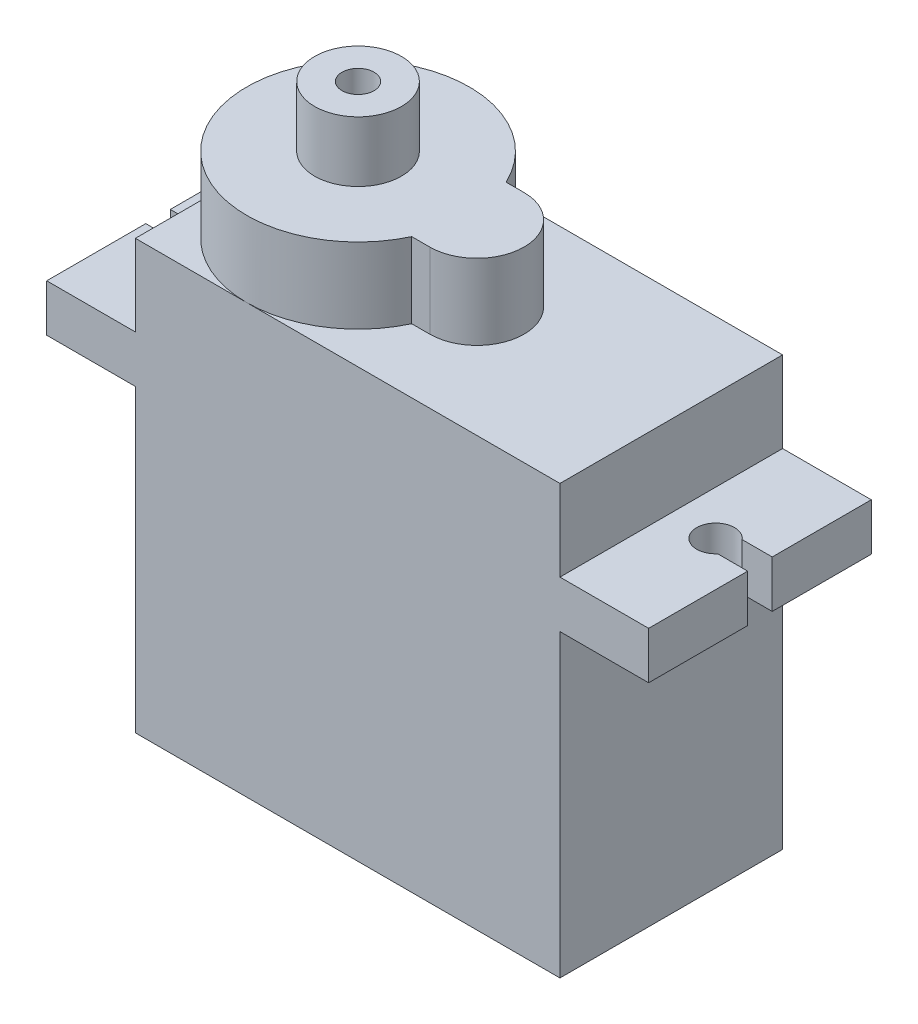
ISO-10303-21;
HEADER;
FILE_DESCRIPTION(('STEP AP214'),'2;1');
FILE_NAME('part.step','',(''),(''),'','','');
FILE_SCHEMA(('AUTOMOTIVE_DESIGN { 1 0 10303 214 1 1 1 1 }'));
ENDSEC;
DATA;
#1=APPLICATION_CONTEXT('core data for automotive mechanical design processes');
#2=APPLICATION_PROTOCOL_DEFINITION('international standard','automotive_design',2000,#1);
#3=PRODUCT_CONTEXT('',#1,'mechanical');
#4=PRODUCT('Part','Part','',(#3));
#5=PRODUCT_RELATED_PRODUCT_CATEGORY('part','',(#4));
#6=PRODUCT_DEFINITION_FORMATION('','',#4);
#7=PRODUCT_DEFINITION_CONTEXT('part definition',#1,'design');
#8=PRODUCT_DEFINITION('design','',#6,#7);
#9=PRODUCT_DEFINITION_SHAPE('','',#8);
#10=(LENGTH_UNIT() NAMED_UNIT(*) SI_UNIT(.MILLI.,.METRE.));
#11=(NAMED_UNIT(*) PLANE_ANGLE_UNIT() SI_UNIT($,.RADIAN.));
#12=(NAMED_UNIT(*) SI_UNIT($,.STERADIAN.) SOLID_ANGLE_UNIT());
#13=UNCERTAINTY_MEASURE_WITH_UNIT(LENGTH_MEASURE(1.E-05),#10,'distance_accuracy_value','');
#14=(GEOMETRIC_REPRESENTATION_CONTEXT(3) GLOBAL_UNCERTAINTY_ASSIGNED_CONTEXT((#13)) GLOBAL_UNIT_ASSIGNED_CONTEXT((#10,
#11,#12)) REPRESENTATION_CONTEXT('',''));
#15=CARTESIAN_POINT('',(0.,0.,0.));
#16=DIRECTION('',(0.,0.,1.));
#17=DIRECTION('',(1.,0.,0.));
#18=AXIS2_PLACEMENT_3D('',#15,#16,#17);
#19=CARTESIAN_POINT('',(-4.7,18.39999995,-11.8));
#20=DIRECTION('',(-1.,0.,0.));
#21=DIRECTION('',(0.,0.,1.));
#22=AXIS2_PLACEMENT_3D('',#19,#20,#21);
#23=PLANE('',#22);
#24=DIRECTION('',(0.,1.,0.));
#25=VECTOR('',#24,1.);
#26=CARTESIAN_POINT('',(-4.7,11.9983977150201,-5.25));
#27=LINE('',#26,#25);
#28=CARTESIAN_POINT('',(-4.7,15.89999995,-5.25));
#29=VERTEX_POINT('',#28);
#30=CARTESIAN_POINT('',(-4.7,18.39999995,-5.25));
#31=VERTEX_POINT('',#30);
#32=EDGE_CURVE('E208',#29,#31,#27,.T.);
#33=ORIENTED_EDGE('',*,*,#32,.F.);
#34=DIRECTION('',(0.,0.,-1.));
#35=VECTOR('',#34,1.);
#36=CARTESIAN_POINT('',(-4.7,15.89999995,-11.8));
#37=LINE('',#36,#35);
#38=CARTESIAN_POINT('',(-4.7,15.89999995,0.));
#39=VERTEX_POINT('',#38);
#40=EDGE_CURVE('E218',#39,#29,#37,.T.);
#41=ORIENTED_EDGE('',*,*,#40,.F.);
#42=DIRECTION('',(0.,-1.,0.));
#43=VECTOR('',#42,1.);
#44=CARTESIAN_POINT('',(-4.7,18.39999995,0.));
#45=LINE('',#44,#43);
#46=CARTESIAN_POINT('',(-4.7,18.39999995,0.));
#47=VERTEX_POINT('',#46);
#48=EDGE_CURVE('E241',#47,#39,#45,.T.);
#49=ORIENTED_EDGE('',*,*,#48,.F.);
#50=DIRECTION('',(0.,0.,-1.));
#51=VECTOR('',#50,1.);
#52=CARTESIAN_POINT('',(-4.7,18.39999995,-11.8));
#53=LINE('',#52,#51);
#54=EDGE_CURVE('E221',#47,#31,#53,.T.);
#55=ORIENTED_EDGE('',*,*,#54,.T.);
#56=EDGE_LOOP('',(#33,#41,#49,#55));
#57=FACE_BOUND('',#56,.T.);
#58=ADVANCED_FACE('F34',(#57),#23,.T.);
#59=CARTESIAN_POINT('',(27.2,18.39999995,-11.8));
#60=DIRECTION('',(1.,0.,0.));
#61=DIRECTION('',(0.,0.,-1.));
#62=AXIS2_PLACEMENT_3D('',#59,#60,#61);
#63=PLANE('',#62);
#64=DIRECTION('',(0.,1.,0.));
#65=VECTOR('',#64,1.);
#66=CARTESIAN_POINT('',(27.2,11.9983977150201,-5.25));
#67=LINE('',#66,#65);
#68=CARTESIAN_POINT('',(27.2,15.89999995,-5.25));
#69=VERTEX_POINT('',#68);
#70=CARTESIAN_POINT('',(27.2,18.39999995,-5.25));
#71=VERTEX_POINT('',#70);
#72=EDGE_CURVE('E391',#69,#71,#67,.T.);
#73=ORIENTED_EDGE('',*,*,#72,.T.);
#74=DIRECTION('',(0.,0.,1.));
#75=VECTOR('',#74,1.);
#76=CARTESIAN_POINT('',(27.2,18.39999995,-11.8));
#77=LINE('',#76,#75);
#78=CARTESIAN_POINT('',(27.2,18.39999995,0.));
#79=VERTEX_POINT('',#78);
#80=EDGE_CURVE('E429',#71,#79,#77,.T.);
#81=ORIENTED_EDGE('',*,*,#80,.T.);
#82=DIRECTION('',(0.,-1.,0.));
#83=VECTOR('',#82,1.);
#84=CARTESIAN_POINT('',(27.2,18.39999995,0.));
#85=LINE('',#84,#83);
#86=CARTESIAN_POINT('',(27.2,15.89999995,0.));
#87=VERTEX_POINT('',#86);
#88=EDGE_CURVE('E321',#79,#87,#85,.T.);
#89=ORIENTED_EDGE('',*,*,#88,.T.);
#90=DIRECTION('',(0.,0.,1.));
#91=VECTOR('',#90,1.);
#92=CARTESIAN_POINT('',(27.2,15.89999995,-11.8));
#93=LINE('',#92,#91);
#94=EDGE_CURVE('E331',#69,#87,#93,.T.);
#95=ORIENTED_EDGE('',*,*,#94,.F.);
#96=EDGE_LOOP('',(#73,#81,#89,#95));
#97=FACE_BOUND('',#96,.T.);
#98=ADVANCED_FACE('F437',(#97),#63,.T.);
#99=CARTESIAN_POINT('',(0.,22.7,0.));
#100=DIRECTION('',(0.,-1.,0.));
#101=DIRECTION('',(0.,0.,-1.));
#102=AXIS2_PLACEMENT_3D('',#99,#100,#101);
#103=PLANE('',#102);
#104=CARTESIAN_POINT('',(5.9,22.7,-5.9));
#105=DIRECTION('',(0.,1.,0.));
#106=DIRECTION('',(0.,0.,1.));
#107=AXIS2_PLACEMENT_3D('',#104,#105,#106);
#108=CIRCLE('',#107,5.9);
#109=CARTESIAN_POINT('',(0.,22.7,-5.9));
#110=VERTEX_POINT('',#109);
#111=CARTESIAN_POINT('',(5.9,22.7,0.));
#112=VERTEX_POINT('',#111);
#113=EDGE_CURVE('E42',#110,#112,#108,.T.);
#114=ORIENTED_EDGE('',*,*,#113,.F.);
#115=DIRECTION('',(0.,0.,1.));
#116=VECTOR('',#115,1.);
#117=CARTESIAN_POINT('',(0.,22.7,0.));
#118=LINE('',#117,#116);
#119=CARTESIAN_POINT('',(0.,22.7,0.));
#120=VERTEX_POINT('',#119);
#121=EDGE_CURVE('E248',#110,#120,#118,.T.);
#122=ORIENTED_EDGE('',*,*,#121,.T.);
#123=DIRECTION('',(1.,0.,0.));
#124=VECTOR('',#123,1.);
#125=CARTESIAN_POINT('',(0.,22.7,0.));
#126=LINE('',#125,#124);
#127=EDGE_CURVE('E249',#120,#112,#126,.T.);
#128=ORIENTED_EDGE('',*,*,#127,.T.);
#129=EDGE_LOOP('',(#114,#122,#128));
#130=FACE_BOUND('',#129,.T.);
#131=ADVANCED_FACE('F455',(#130),#103,.F.);
#132=CARTESIAN_POINT('',(11.244155686355,22.7,-3.4));
#133=VERTEX_POINT('',#132);
#134=EDGE_CURVE('E289',#112,#133,#108,.T.);
#135=ORIENTED_EDGE('',*,*,#134,.F.);
#136=CARTESIAN_POINT('',(22.5,22.7,0.));
#137=VERTEX_POINT('',#136);
#138=EDGE_CURVE('E247',#112,#137,#126,.T.);
#139=ORIENTED_EDGE('',*,*,#138,.T.);
#140=DIRECTION('',(0.,0.,-1.));
#141=VECTOR('',#140,1.);
#142=CARTESIAN_POINT('',(22.5,22.7,0.));
#143=LINE('',#142,#141);
#144=CARTESIAN_POINT('',(22.5,22.7,-11.8));
#145=VERTEX_POINT('',#144);
#146=EDGE_CURVE('E252',#137,#145,#143,.T.);
#147=ORIENTED_EDGE('',*,*,#146,.T.);
#148=DIRECTION('',(-1.,0.,0.));
#149=VECTOR('',#148,1.);
#150=CARTESIAN_POINT('',(0.,22.7,-11.8));
#151=LINE('',#150,#149);
#152=CARTESIAN_POINT('',(5.9,22.7,-11.8));
#153=VERTEX_POINT('',#152);
#154=EDGE_CURVE('E255',#145,#153,#151,.T.);
#155=ORIENTED_EDGE('',*,*,#154,.T.);
#156=CARTESIAN_POINT('',(11.244155686355,22.7,-8.4));
#157=VERTEX_POINT('',#156);
#158=EDGE_CURVE('E291',#157,#153,#108,.T.);
#159=ORIENTED_EDGE('',*,*,#158,.F.);
#160=DIRECTION('',(-1.,0.,0.));
#161=VECTOR('',#160,1.);
#162=CARTESIAN_POINT('',(12.2,22.7,-8.4));
#163=LINE('',#162,#161);
#164=CARTESIAN_POINT('',(12.2,22.7,-8.4));
#165=VERTEX_POINT('',#164);
#166=EDGE_CURVE('E410',#165,#157,#163,.T.);
#167=ORIENTED_EDGE('',*,*,#166,.F.);
#168=CARTESIAN_POINT('',(12.2,22.7,-5.9));
#169=DIRECTION('',(0.,1.,0.));
#170=DIRECTION('',(0.,0.,1.));
#171=AXIS2_PLACEMENT_3D('',#168,#169,#170);
#172=CIRCLE('',#171,2.5);
#173=CARTESIAN_POINT('',(12.2,22.7,-3.4));
#174=VERTEX_POINT('',#173);
#175=EDGE_CURVE('E371',#174,#165,#172,.T.);
#176=ORIENTED_EDGE('',*,*,#175,.F.);
#177=DIRECTION('',(1.,0.,0.));
#178=VECTOR('',#177,1.);
#179=CARTESIAN_POINT('',(12.2,22.7,-3.4));
#180=LINE('',#179,#178);
#181=EDGE_CURVE('E401',#133,#174,#180,.T.);
#182=ORIENTED_EDGE('',*,*,#181,.F.);
#183=EDGE_LOOP('',(#135,#139,#147,#155,#159,#167,#176,#182));
#184=FACE_BOUND('',#183,.T.);
#185=ADVANCED_FACE('F451',(#184),#103,.F.);
#186=EDGE_CURVE('E283',#153,#110,#108,.T.);
#187=ORIENTED_EDGE('',*,*,#186,.F.);
#188=CARTESIAN_POINT('',(0.,22.7,-11.8));
#189=VERTEX_POINT('',#188);
#190=EDGE_CURVE('E254',#153,#189,#151,.T.);
#191=ORIENTED_EDGE('',*,*,#190,.T.);
#192=EDGE_CURVE('E244',#189,#110,#118,.T.);
#193=ORIENTED_EDGE('',*,*,#192,.T.);
#194=EDGE_LOOP('',(#187,#191,#193));
#195=FACE_BOUND('',#194,.T.);
#196=ADVANCED_FACE('F461',(#195),#103,.F.);
#197=CARTESIAN_POINT('',(22.5,22.7,0.));
#198=DIRECTION('',(-1.,0.,0.));
#199=DIRECTION('',(0.,0.,1.));
#200=AXIS2_PLACEMENT_3D('',#197,#198,#199);
#201=PLANE('',#200);
#202=DIRECTION('',(0.,0.,-1.));
#203=VECTOR('',#202,1.);
#204=CARTESIAN_POINT('',(22.5,15.89999995,-11.8));
#205=LINE('',#204,#203);
#206=CARTESIAN_POINT('',(22.5,15.89999995,0.));
#207=VERTEX_POINT('',#206);
#208=CARTESIAN_POINT('',(22.5,15.89999995,-11.8));
#209=VERTEX_POINT('',#208);
#210=EDGE_CURVE('E315',#207,#209,#205,.T.);
#211=ORIENTED_EDGE('',*,*,#210,.F.);
#212=DIRECTION('',(0.,-1.,0.));
#213=VECTOR('',#212,1.);
#214=CARTESIAN_POINT('',(22.5,22.7,0.));
#215=LINE('',#214,#213);
#216=CARTESIAN_POINT('',(22.5,0.,0.));
#217=VERTEX_POINT('',#216);
#218=EDGE_CURVE('E277',#207,#217,#215,.T.);
#219=ORIENTED_EDGE('',*,*,#218,.T.);
#220=DIRECTION('',(0.,0.,-1.));
#221=VECTOR('',#220,1.);
#222=CARTESIAN_POINT('',(22.5,0.,0.));
#223=LINE('',#222,#221);
#224=CARTESIAN_POINT('',(22.5,0.,-11.8));
#225=VERTEX_POINT('',#224);
#226=EDGE_CURVE('E264',#217,#225,#223,.T.);
#227=ORIENTED_EDGE('',*,*,#226,.T.);
#228=DIRECTION('',(0.,-1.,0.));
#229=VECTOR('',#228,1.);
#230=CARTESIAN_POINT('',(22.5,22.7,-11.8));
#231=LINE('',#230,#229);
#232=EDGE_CURVE('E273',#209,#225,#231,.T.);
#233=ORIENTED_EDGE('',*,*,#232,.F.);
#234=EDGE_LOOP('',(#211,#219,#227,#233));
#235=FACE_BOUND('',#234,.T.);
#236=ADVANCED_FACE('F314',(#235),#201,.F.);
#237=CARTESIAN_POINT('',(0.,22.7,0.));
#238=DIRECTION('',(1.,0.,0.));
#239=DIRECTION('',(0.,0.,-1.));
#240=AXIS2_PLACEMENT_3D('',#237,#238,#239);
#241=PLANE('',#240);
#242=DIRECTION('',(0.,0.,1.));
#243=VECTOR('',#242,1.);
#244=CARTESIAN_POINT('',(0.,15.89999995,0.));
#245=LINE('',#244,#243);
#246=CARTESIAN_POINT('',(0.,15.89999995,-11.8));
#247=VERTEX_POINT('',#246);
#248=CARTESIAN_POINT('',(0.,15.89999995,0.));
#249=VERTEX_POINT('',#248);
#250=EDGE_CURVE('E230',#247,#249,#245,.T.);
#251=ORIENTED_EDGE('',*,*,#250,.F.);
#252=DIRECTION('',(0.,-1.,0.));
#253=VECTOR('',#252,1.);
#254=CARTESIAN_POINT('',(0.,22.7,-11.8));
#255=LINE('',#254,#253);
#256=CARTESIAN_POINT('',(0.,0.,-11.8));
#257=VERTEX_POINT('',#256);
#258=EDGE_CURVE('E258',#247,#257,#255,.T.);
#259=ORIENTED_EDGE('',*,*,#258,.T.);
#260=DIRECTION('',(0.,0.,1.));
#261=VECTOR('',#260,1.);
#262=CARTESIAN_POINT('',(0.,0.,0.));
#263=LINE('',#262,#261);
#264=CARTESIAN_POINT('',(0.,0.,0.));
#265=VERTEX_POINT('',#264);
#266=EDGE_CURVE('E240',#257,#265,#263,.T.);
#267=ORIENTED_EDGE('',*,*,#266,.T.);
#268=DIRECTION('',(0.,-1.,0.));
#269=VECTOR('',#268,1.);
#270=CARTESIAN_POINT('',(0.,22.7,0.));
#271=LINE('',#270,#269);
#272=EDGE_CURVE('E280',#249,#265,#271,.T.);
#273=ORIENTED_EDGE('',*,*,#272,.F.);
#274=EDGE_LOOP('',(#251,#259,#267,#273));
#275=FACE_BOUND('',#274,.T.);
#276=ADVANCED_FACE('F303',(#275),#241,.F.);
#277=CARTESIAN_POINT('',(0.,18.39999995,-11.8));
#278=VERTEX_POINT('',#277);
#279=EDGE_CURVE('E270',#189,#278,#255,.T.);
#280=ORIENTED_EDGE('',*,*,#279,.T.);
#281=DIRECTION('',(0.,0.,1.));
#282=VECTOR('',#281,1.);
#283=CARTESIAN_POINT('',(0.,18.39999995,0.));
#284=LINE('',#283,#282);
#285=CARTESIAN_POINT('',(0.,18.39999995,0.));
#286=VERTEX_POINT('',#285);
#287=EDGE_CURVE('E243',#278,#286,#284,.T.);
#288=ORIENTED_EDGE('',*,*,#287,.T.);
#289=EDGE_CURVE('E281',#120,#286,#271,.T.);
#290=ORIENTED_EDGE('',*,*,#289,.F.);
#291=ORIENTED_EDGE('',*,*,#121,.F.);
#292=ORIENTED_EDGE('',*,*,#192,.F.);
#293=EDGE_LOOP('',(#280,#288,#290,#291,#292));
#294=FACE_BOUND('',#293,.T.);
#295=ADVANCED_FACE('F36',(#294),#241,.F.);
#296=CARTESIAN_POINT('',(0.,22.7,0.));
#297=DIRECTION('',(0.,0.,-1.));
#298=DIRECTION('',(-1.,0.,0.));
#299=AXIS2_PLACEMENT_3D('',#296,#297,#298);
#300=PLANE('',#299);
#301=DIRECTION('',(1.,0.,0.));
#302=VECTOR('',#301,1.);
#303=CARTESIAN_POINT('',(0.,0.,0.));
#304=LINE('',#303,#302);
#305=EDGE_CURVE('E261',#265,#217,#304,.T.);
#306=ORIENTED_EDGE('',*,*,#305,.T.);
#307=ORIENTED_EDGE('',*,*,#218,.F.);
#308=DIRECTION('',(-1.,0.,0.));
#309=VECTOR('',#308,1.);
#310=CARTESIAN_POINT('',(27.2,15.89999995,0.));
#311=LINE('',#310,#309);
#312=EDGE_CURVE('E318',#87,#207,#311,.T.);
#313=ORIENTED_EDGE('',*,*,#312,.F.);
#314=ORIENTED_EDGE('',*,*,#88,.F.);
#315=DIRECTION('',(-1.,0.,0.));
#316=VECTOR('',#315,1.);
#317=CARTESIAN_POINT('',(27.2,18.39999995,0.));
#318=LINE('',#317,#316);
#319=CARTESIAN_POINT('',(22.5,18.39999995,0.));
#320=VERTEX_POINT('',#319);
#321=EDGE_CURVE('E338',#79,#320,#318,.T.);
#322=ORIENTED_EDGE('',*,*,#321,.T.);
#323=EDGE_CURVE('E278',#137,#320,#215,.T.);
#324=ORIENTED_EDGE('',*,*,#323,.F.);
#325=ORIENTED_EDGE('',*,*,#138,.F.);
#326=ORIENTED_EDGE('',*,*,#127,.F.);
#327=ORIENTED_EDGE('',*,*,#289,.T.);
#328=DIRECTION('',(-1.,0.,0.));
#329=VECTOR('',#328,1.);
#330=CARTESIAN_POINT('',(-4.7,18.39999995,0.));
#331=LINE('',#330,#329);
#332=EDGE_CURVE('E236',#286,#47,#331,.T.);
#333=ORIENTED_EDGE('',*,*,#332,.T.);
#334=ORIENTED_EDGE('',*,*,#48,.T.);
#335=DIRECTION('',(-1.,0.,0.));
#336=VECTOR('',#335,1.);
#337=CARTESIAN_POINT('',(-4.7,15.89999995,0.));
#338=LINE('',#337,#336);
#339=EDGE_CURVE('E226',#249,#39,#338,.T.);
#340=ORIENTED_EDGE('',*,*,#339,.F.);
#341=ORIENTED_EDGE('',*,*,#272,.T.);
#342=EDGE_LOOP('',(#306,#307,#313,#314,#322,#324,#325,#326,#327,#333,#334,#340,#341));
#343=FACE_BOUND('',#342,.T.);
#344=ADVANCED_FACE('F294',(#343),#300,.F.);
#345=ORIENTED_EDGE('',*,*,#323,.T.);
#346=DIRECTION('',(0.,0.,-1.));
#347=VECTOR('',#346,1.);
#348=CARTESIAN_POINT('',(22.5,18.39999995,-11.8));
#349=LINE('',#348,#347);
#350=CARTESIAN_POINT('',(22.5,18.39999995,-11.8));
#351=VERTEX_POINT('',#350);
#352=EDGE_CURVE('E324',#320,#351,#349,.T.);
#353=ORIENTED_EDGE('',*,*,#352,.T.);
#354=EDGE_CURVE('E274',#145,#351,#231,.T.);
#355=ORIENTED_EDGE('',*,*,#354,.F.);
#356=ORIENTED_EDGE('',*,*,#146,.F.);
#357=EDGE_LOOP('',(#345,#353,#355,#356));
#358=FACE_BOUND('',#357,.T.);
#359=ADVANCED_FACE('F447',(#358),#201,.F.);
#360=CARTESIAN_POINT('',(0.,22.7,-11.8));
#361=DIRECTION('',(0.,0.,1.));
#362=DIRECTION('',(1.,0.,0.));
#363=AXIS2_PLACEMENT_3D('',#360,#361,#362);
#364=PLANE('',#363);
#365=DIRECTION('',(-1.,0.,0.));
#366=VECTOR('',#365,1.);
#367=CARTESIAN_POINT('',(0.,0.,-11.8));
#368=LINE('',#367,#366);
#369=EDGE_CURVE('E267',#225,#257,#368,.T.);
#370=ORIENTED_EDGE('',*,*,#369,.T.);
#371=ORIENTED_EDGE('',*,*,#258,.F.);
#372=DIRECTION('',(1.,0.,0.));
#373=VECTOR('',#372,1.);
#374=CARTESIAN_POINT('',(0.,15.89999995,-11.8));
#375=LINE('',#374,#373);
#376=CARTESIAN_POINT('',(-4.7,15.89999995,-11.8));
#377=VERTEX_POINT('',#376);
#378=EDGE_CURVE('E227',#377,#247,#375,.T.);
#379=ORIENTED_EDGE('',*,*,#378,.F.);
#380=DIRECTION('',(0.,-1.,0.));
#381=VECTOR('',#380,1.);
#382=CARTESIAN_POINT('',(-4.7,18.39999995,-11.8));
#383=LINE('',#382,#381);
#384=CARTESIAN_POINT('',(-4.7,18.39999995,-11.8));
#385=VERTEX_POINT('',#384);
#386=EDGE_CURVE('E237',#385,#377,#383,.T.);
#387=ORIENTED_EDGE('',*,*,#386,.F.);
#388=DIRECTION('',(1.,0.,0.));
#389=VECTOR('',#388,1.);
#390=CARTESIAN_POINT('',(0.,18.39999995,-11.8));
#391=LINE('',#390,#389);
#392=EDGE_CURVE('E342',#385,#278,#391,.T.);
#393=ORIENTED_EDGE('',*,*,#392,.T.);
#394=ORIENTED_EDGE('',*,*,#279,.F.);
#395=ORIENTED_EDGE('',*,*,#190,.F.);
#396=ORIENTED_EDGE('',*,*,#154,.F.);
#397=ORIENTED_EDGE('',*,*,#354,.T.);
#398=DIRECTION('',(1.,0.,0.));
#399=VECTOR('',#398,1.);
#400=CARTESIAN_POINT('',(22.5,18.39999995,-11.8));
#401=LINE('',#400,#399);
#402=CARTESIAN_POINT('',(27.2,18.39999995,-11.8));
#403=VERTEX_POINT('',#402);
#404=EDGE_CURVE('E328',#351,#403,#401,.T.);
#405=ORIENTED_EDGE('',*,*,#404,.T.);
#406=DIRECTION('',(0.,-1.,0.));
#407=VECTOR('',#406,1.);
#408=CARTESIAN_POINT('',(27.2,18.39999995,-11.8));
#409=LINE('',#408,#407);
#410=CARTESIAN_POINT('',(27.2,15.89999995,-11.8));
#411=VERTEX_POINT('',#410);
#412=EDGE_CURVE('E336',#403,#411,#409,.T.);
#413=ORIENTED_EDGE('',*,*,#412,.T.);
#414=DIRECTION('',(1.,0.,0.));
#415=VECTOR('',#414,1.);
#416=CARTESIAN_POINT('',(22.5,15.89999995,-11.8));
#417=LINE('',#416,#415);
#418=EDGE_CURVE('E310',#209,#411,#417,.T.);
#419=ORIENTED_EDGE('',*,*,#418,.F.);
#420=ORIENTED_EDGE('',*,*,#232,.T.);
#421=EDGE_LOOP('',(#370,#371,#379,#387,#393,#394,#395,#396,#397,#405,#413,#419,#420));
#422=FACE_BOUND('',#421,.T.);
#423=ADVANCED_FACE('F307',(#422),#364,.F.);
#424=CARTESIAN_POINT('',(0.,0.,0.));
#425=DIRECTION('',(0.,-1.,0.));
#426=DIRECTION('',(0.,0.,-1.));
#427=AXIS2_PLACEMENT_3D('',#424,#425,#426);
#428=PLANE('',#427);
#429=ORIENTED_EDGE('',*,*,#266,.F.);
#430=ORIENTED_EDGE('',*,*,#369,.F.);
#431=ORIENTED_EDGE('',*,*,#226,.F.);
#432=ORIENTED_EDGE('',*,*,#305,.F.);
#433=EDGE_LOOP('',(#429,#430,#431,#432));
#434=FACE_BOUND('',#433,.T.);
#435=ADVANCED_FACE('F301',(#434),#428,.T.);
#436=DIRECTION('',(0.,1.,0.));
#437=VECTOR('',#436,1.);
#438=CARTESIAN_POINT('',(-4.7,11.9983977150201,-6.55));
#439=LINE('',#438,#437);
#440=CARTESIAN_POINT('',(-4.7,15.89999995,-6.55));
#441=VERTEX_POINT('',#440);
#442=CARTESIAN_POINT('',(-4.7,18.39999995,-6.55));
#443=VERTEX_POINT('',#442);
#444=EDGE_CURVE('E49',#441,#443,#439,.T.);
#445=ORIENTED_EDGE('',*,*,#444,.T.);
#446=EDGE_CURVE('E340',#443,#385,#53,.T.);
#447=ORIENTED_EDGE('',*,*,#446,.T.);
#448=ORIENTED_EDGE('',*,*,#386,.T.);
#449=EDGE_CURVE('E228',#441,#377,#37,.T.);
#450=ORIENTED_EDGE('',*,*,#449,.F.);
#451=EDGE_LOOP('',(#445,#447,#448,#450));
#452=FACE_BOUND('',#451,.T.);
#453=ADVANCED_FACE('F465',(#452),#23,.T.);
#454=CARTESIAN_POINT('',(0.,18.39999995,0.));
#455=DIRECTION('',(0.,1.,0.));
#456=DIRECTION('',(0.,0.,1.));
#457=AXIS2_PLACEMENT_3D('',#454,#455,#456);
#458=PLANE('',#457);
#459=DIRECTION('',(1.,0.,0.));
#460=VECTOR('',#459,1.);
#461=CARTESIAN_POINT('',(-4.7,18.39999995,-5.25));
#462=LINE('',#461,#460);
#463=CARTESIAN_POINT('',(-3.10993420767853,18.39999995,-5.25));
#464=VERTEX_POINT('',#463);
#465=EDGE_CURVE('E354',#31,#464,#462,.T.);
#466=ORIENTED_EDGE('',*,*,#465,.F.);
#467=ORIENTED_EDGE('',*,*,#54,.F.);
#468=ORIENTED_EDGE('',*,*,#332,.F.);
#469=ORIENTED_EDGE('',*,*,#287,.F.);
#470=ORIENTED_EDGE('',*,*,#392,.F.);
#471=ORIENTED_EDGE('',*,*,#446,.F.);
#472=DIRECTION('',(-1.,0.,0.));
#473=VECTOR('',#472,1.);
#474=CARTESIAN_POINT('',(-4.7,18.39999995,-6.55));
#475=LINE('',#474,#473);
#476=CARTESIAN_POINT('',(-3.10993420767853,18.39999995,-6.55));
#477=VERTEX_POINT('',#476);
#478=EDGE_CURVE('E357',#477,#443,#475,.T.);
#479=ORIENTED_EDGE('',*,*,#478,.F.);
#480=CARTESIAN_POINT('',(-2.35,18.39999995,-5.9));
#481=DIRECTION('',(0.,1.,0.));
#482=DIRECTION('',(0.,0.,1.));
#483=AXIS2_PLACEMENT_3D('',#480,#481,#482);
#484=CIRCLE('',#483,1.);
#485=EDGE_CURVE('E222',#464,#477,#484,.T.);
#486=ORIENTED_EDGE('',*,*,#485,.F.);
#487=EDGE_LOOP('',(#466,#467,#468,#469,#470,#471,#479,#486));
#488=FACE_BOUND('',#487,.T.);
#489=ADVANCED_FACE('F351',(#488),#458,.T.);
#490=CARTESIAN_POINT('',(0.,15.89999995,0.));
#491=DIRECTION('',(0.,1.,0.));
#492=DIRECTION('',(0.,0.,1.));
#493=AXIS2_PLACEMENT_3D('',#490,#491,#492);
#494=PLANE('',#493);
#495=ORIENTED_EDGE('',*,*,#40,.T.);
#496=DIRECTION('',(1.,0.,0.));
#497=VECTOR('',#496,1.);
#498=CARTESIAN_POINT('',(-4.7,15.89999995,-5.25));
#499=LINE('',#498,#497);
#500=CARTESIAN_POINT('',(-3.10993420767853,15.89999995,-5.25));
#501=VERTEX_POINT('',#500);
#502=EDGE_CURVE('E204',#29,#501,#499,.T.);
#503=ORIENTED_EDGE('',*,*,#502,.T.);
#504=CARTESIAN_POINT('',(-2.35,15.89999995,-5.9));
#505=DIRECTION('',(0.,-1.,0.));
#506=DIRECTION('',(0.,0.,-1.));
#507=AXIS2_PLACEMENT_3D('',#504,#505,#506);
#508=CIRCLE('',#507,1.);
#509=CARTESIAN_POINT('',(-3.10993420767853,15.89999995,-6.55));
#510=VERTEX_POINT('',#509);
#511=EDGE_CURVE('E366',#501,#510,#508,.F.);
#512=ORIENTED_EDGE('',*,*,#511,.T.);
#513=DIRECTION('',(-1.,0.,0.));
#514=VECTOR('',#513,1.);
#515=CARTESIAN_POINT('',(-4.7,15.89999995,-6.55));
#516=LINE('',#515,#514);
#517=EDGE_CURVE('E363',#510,#441,#516,.T.);
#518=ORIENTED_EDGE('',*,*,#517,.T.);
#519=ORIENTED_EDGE('',*,*,#449,.T.);
#520=ORIENTED_EDGE('',*,*,#378,.T.);
#521=ORIENTED_EDGE('',*,*,#250,.T.);
#522=ORIENTED_EDGE('',*,*,#339,.T.);
#523=EDGE_LOOP('',(#495,#503,#512,#518,#519,#520,#521,#522));
#524=FACE_BOUND('',#523,.T.);
#525=ADVANCED_FACE('F224',(#524),#494,.F.);
#526=DIRECTION('',(0.,1.,0.));
#527=VECTOR('',#526,1.);
#528=CARTESIAN_POINT('',(27.2,11.9983977150201,-6.55));
#529=LINE('',#528,#527);
#530=CARTESIAN_POINT('',(27.2,15.89999995,-6.55));
#531=VERTEX_POINT('',#530);
#532=CARTESIAN_POINT('',(27.2,18.39999995,-6.55));
#533=VERTEX_POINT('',#532);
#534=EDGE_CURVE('E387',#531,#533,#529,.T.);
#535=ORIENTED_EDGE('',*,*,#534,.F.);
#536=EDGE_CURVE('E325',#411,#531,#93,.T.);
#537=ORIENTED_EDGE('',*,*,#536,.F.);
#538=ORIENTED_EDGE('',*,*,#412,.F.);
#539=EDGE_CURVE('E430',#403,#533,#77,.T.);
#540=ORIENTED_EDGE('',*,*,#539,.T.);
#541=EDGE_LOOP('',(#535,#537,#538,#540));
#542=FACE_BOUND('',#541,.T.);
#543=ADVANCED_FACE('F486',(#542),#63,.T.);
#544=CARTESIAN_POINT('',(0.,18.39999995,0.));
#545=DIRECTION('',(0.,-1.,0.));
#546=DIRECTION('',(0.,0.,-1.));
#547=AXIS2_PLACEMENT_3D('',#544,#545,#546);
#548=PLANE('',#547);
#549=ORIENTED_EDGE('',*,*,#80,.F.);
#550=DIRECTION('',(1.,0.,0.));
#551=VECTOR('',#550,1.);
#552=CARTESIAN_POINT('',(27.2,18.39999995,-5.25));
#553=LINE('',#552,#551);
#554=CARTESIAN_POINT('',(25.6099342076785,18.39999995,-5.25));
#555=VERTEX_POINT('',#554);
#556=EDGE_CURVE('E372',#555,#71,#553,.T.);
#557=ORIENTED_EDGE('',*,*,#556,.F.);
#558=CARTESIAN_POINT('',(24.85,18.39999995,-5.9));
#559=DIRECTION('',(0.,1.,0.));
#560=DIRECTION('',(0.,0.,1.));
#561=AXIS2_PLACEMENT_3D('',#558,#559,#560);
#562=CIRCLE('',#561,1.);
#563=CARTESIAN_POINT('',(25.6099342076785,18.39999995,-6.55));
#564=VERTEX_POINT('',#563);
#565=EDGE_CURVE('E375',#564,#555,#562,.T.);
#566=ORIENTED_EDGE('',*,*,#565,.F.);
#567=DIRECTION('',(-1.,0.,0.));
#568=VECTOR('',#567,1.);
#569=CARTESIAN_POINT('',(27.2,18.39999995,-6.55));
#570=LINE('',#569,#568);
#571=EDGE_CURVE('E378',#533,#564,#570,.T.);
#572=ORIENTED_EDGE('',*,*,#571,.F.);
#573=ORIENTED_EDGE('',*,*,#539,.F.);
#574=ORIENTED_EDGE('',*,*,#404,.F.);
#575=ORIENTED_EDGE('',*,*,#352,.F.);
#576=ORIENTED_EDGE('',*,*,#321,.F.);
#577=EDGE_LOOP('',(#549,#557,#566,#572,#573,#574,#575,#576));
#578=FACE_BOUND('',#577,.T.);
#579=ADVANCED_FACE('F441',(#578),#548,.F.);
#580=CARTESIAN_POINT('',(0.,15.89999995,0.));
#581=DIRECTION('',(0.,-1.,0.));
#582=DIRECTION('',(0.,0.,-1.));
#583=AXIS2_PLACEMENT_3D('',#580,#581,#582);
#584=PLANE('',#583);
#585=DIRECTION('',(1.,0.,0.));
#586=VECTOR('',#585,1.);
#587=CARTESIAN_POINT('',(27.2,15.89999995,-5.25));
#588=LINE('',#587,#586);
#589=CARTESIAN_POINT('',(25.6099342076785,15.89999995,-5.25));
#590=VERTEX_POINT('',#589);
#591=EDGE_CURVE('E388',#590,#69,#588,.T.);
#592=ORIENTED_EDGE('',*,*,#591,.T.);
#593=ORIENTED_EDGE('',*,*,#94,.T.);
#594=ORIENTED_EDGE('',*,*,#312,.T.);
#595=ORIENTED_EDGE('',*,*,#210,.T.);
#596=ORIENTED_EDGE('',*,*,#418,.T.);
#597=ORIENTED_EDGE('',*,*,#536,.T.);
#598=DIRECTION('',(-1.,0.,0.));
#599=VECTOR('',#598,1.);
#600=CARTESIAN_POINT('',(27.2,15.89999995,-6.55));
#601=LINE('',#600,#599);
#602=CARTESIAN_POINT('',(25.6099342076785,15.89999995,-6.55));
#603=VERTEX_POINT('',#602);
#604=EDGE_CURVE('E384',#531,#603,#601,.T.);
#605=ORIENTED_EDGE('',*,*,#604,.T.);
#606=CARTESIAN_POINT('',(24.85,15.89999995,-5.9));
#607=DIRECTION('',(0.,-1.,0.));
#608=DIRECTION('',(0.,0.,-1.));
#609=AXIS2_PLACEMENT_3D('',#606,#607,#608);
#610=CIRCLE('',#609,1.);
#611=EDGE_CURVE('E374',#603,#590,#610,.F.);
#612=ORIENTED_EDGE('',*,*,#611,.T.);
#613=EDGE_LOOP('',(#592,#593,#594,#595,#596,#597,#605,#612));
#614=FACE_BOUND('',#613,.T.);
#615=ADVANCED_FACE('F435',(#614),#584,.T.);
#616=CARTESIAN_POINT('',(12.2,26.7,-5.9));
#617=DIRECTION('',(0.,-1.,0.));
#618=DIRECTION('',(0.,0.,-1.));
#619=AXIS2_PLACEMENT_3D('',#616,#617,#618);
#620=CYLINDRICAL_SURFACE('',#619,2.5);
#621=ORIENTED_EDGE('',*,*,#175,.T.);
#622=DIRECTION('',(0.,-1.,0.));
#623=VECTOR('',#622,1.);
#624=CARTESIAN_POINT('',(12.2,26.7,-8.4));
#625=LINE('',#624,#623);
#626=CARTESIAN_POINT('',(12.2,26.7,-8.4));
#627=VERTEX_POINT('',#626);
#628=EDGE_CURVE('E424',#627,#165,#625,.T.);
#629=ORIENTED_EDGE('',*,*,#628,.F.);
#630=CARTESIAN_POINT('',(12.2,26.7,-5.9));
#631=DIRECTION('',(0.,1.,0.));
#632=DIRECTION('',(0.,0.,1.));
#633=AXIS2_PLACEMENT_3D('',#630,#631,#632);
#634=CIRCLE('',#633,2.5);
#635=CARTESIAN_POINT('',(12.2,26.7,-3.4));
#636=VERTEX_POINT('',#635);
#637=EDGE_CURVE('E397',#636,#627,#634,.T.);
#638=ORIENTED_EDGE('',*,*,#637,.F.);
#639=DIRECTION('',(0.,-1.,0.));
#640=VECTOR('',#639,1.);
#641=CARTESIAN_POINT('',(12.2,26.7,-3.4));
#642=LINE('',#641,#640);
#643=EDGE_CURVE('E407',#636,#174,#642,.T.);
#644=ORIENTED_EDGE('',*,*,#643,.T.);
#645=EDGE_LOOP('',(#621,#629,#638,#644));
#646=FACE_BOUND('',#645,.T.);
#647=ADVANCED_FACE('F725',(#646),#620,.T.);
#648=CARTESIAN_POINT('',(12.2,26.7,-8.4));
#649=DIRECTION('',(0.,0.,1.));
#650=DIRECTION('',(1.,0.,0.));
#651=AXIS2_PLACEMENT_3D('',#648,#649,#650);
#652=PLANE('',#651);
#653=ORIENTED_EDGE('',*,*,#166,.T.);
#654=DIRECTION('',(0.,-1.,0.));
#655=VECTOR('',#654,1.);
#656=CARTESIAN_POINT('',(11.244155686355,26.7,-8.4));
#657=LINE('',#656,#655);
#658=CARTESIAN_POINT('',(11.244155686355,26.7,-8.4));
#659=VERTEX_POINT('',#658);
#660=EDGE_CURVE('E421',#659,#157,#657,.T.);
#661=ORIENTED_EDGE('',*,*,#660,.F.);
#662=DIRECTION('',(-1.,0.,0.));
#663=VECTOR('',#662,1.);
#664=CARTESIAN_POINT('',(12.2,26.7,-8.4));
#665=LINE('',#664,#663);
#666=EDGE_CURVE('E400',#627,#659,#665,.T.);
#667=ORIENTED_EDGE('',*,*,#666,.F.);
#668=ORIENTED_EDGE('',*,*,#628,.T.);
#669=EDGE_LOOP('',(#653,#661,#667,#668));
#670=FACE_BOUND('',#669,.T.);
#671=ADVANCED_FACE('F543',(#670),#652,.F.);
#672=CARTESIAN_POINT('',(5.9,26.7,-5.9));
#673=DIRECTION('',(0.,-1.,0.));
#674=DIRECTION('',(0.,0.,-1.));
#675=AXIS2_PLACEMENT_3D('',#672,#673,#674);
#676=CYLINDRICAL_SURFACE('',#675,5.9);
#677=ORIENTED_EDGE('',*,*,#158,.T.);
#678=ORIENTED_EDGE('',*,*,#186,.T.);
#679=ORIENTED_EDGE('',*,*,#113,.T.);
#680=ORIENTED_EDGE('',*,*,#134,.T.);
#681=DIRECTION('',(0.,-1.,0.));
#682=VECTOR('',#681,1.);
#683=CARTESIAN_POINT('',(11.244155686355,26.7,-3.4));
#684=LINE('',#683,#682);
#685=CARTESIAN_POINT('',(11.244155686355,26.7,-3.4));
#686=VERTEX_POINT('',#685);
#687=EDGE_CURVE('E418',#686,#133,#684,.T.);
#688=ORIENTED_EDGE('',*,*,#687,.F.);
#689=CARTESIAN_POINT('',(5.9,26.7,-5.9));
#690=DIRECTION('',(0.,1.,0.));
#691=DIRECTION('',(0.,0.,1.));
#692=AXIS2_PLACEMENT_3D('',#689,#690,#691);
#693=CIRCLE('',#692,5.9);
#694=EDGE_CURVE('E403',#659,#686,#693,.T.);
#695=ORIENTED_EDGE('',*,*,#694,.F.);
#696=ORIENTED_EDGE('',*,*,#660,.T.);
#697=EDGE_LOOP('',(#677,#678,#679,#680,#688,#695,#696));
#698=FACE_BOUND('',#697,.T.);
#699=ADVANCED_FACE('F457',(#698),#676,.T.);
#700=CARTESIAN_POINT('',(12.2,26.7,-3.4));
#701=DIRECTION('',(0.,0.,-1.));
#702=DIRECTION('',(-1.,0.,0.));
#703=AXIS2_PLACEMENT_3D('',#700,#701,#702);
#704=PLANE('',#703);
#705=ORIENTED_EDGE('',*,*,#181,.T.);
#706=ORIENTED_EDGE('',*,*,#643,.F.);
#707=DIRECTION('',(1.,0.,0.));
#708=VECTOR('',#707,1.);
#709=CARTESIAN_POINT('',(12.2,26.7,-3.4));
#710=LINE('',#709,#708);
#711=EDGE_CURVE('E405',#686,#636,#710,.T.);
#712=ORIENTED_EDGE('',*,*,#711,.F.);
#713=ORIENTED_EDGE('',*,*,#687,.T.);
#714=EDGE_LOOP('',(#705,#706,#712,#713));
#715=FACE_BOUND('',#714,.T.);
#716=ADVANCED_FACE('F542',(#715),#704,.F.);
#717=CARTESIAN_POINT('',(12.2,26.7,-5.9));
#718=DIRECTION('',(0.,1.,0.));
#719=DIRECTION('',(0.,0.,1.));
#720=AXIS2_PLACEMENT_3D('',#717,#718,#719);
#721=PLANE('',#720);
#722=CARTESIAN_POINT('',(5.9,26.7,-5.9));
#723=DIRECTION('',(0.,1.,0.));
#724=DIRECTION('',(0.,0.,1.));
#725=AXIS2_PLACEMENT_3D('',#722,#723,#724);
#726=CIRCLE('',#725,2.3);
#727=CARTESIAN_POINT('',(5.9,26.7,-3.6));
#728=VERTEX_POINT('',#727);
#729=EDGE_CURVE('E835',#728,#728,#726,.T.);
#730=ORIENTED_EDGE('',*,*,#729,.F.);
#731=EDGE_LOOP('',(#730));
#732=FACE_BOUND('',#731,.T.);
#733=ORIENTED_EDGE('',*,*,#637,.T.);
#734=ORIENTED_EDGE('',*,*,#666,.T.);
#735=ORIENTED_EDGE('',*,*,#694,.T.);
#736=ORIENTED_EDGE('',*,*,#711,.T.);
#737=EDGE_LOOP('',(#733,#734,#735,#736));
#738=FACE_BOUND('',#737,.T.);
#739=ADVANCED_FACE('F558',(#732,#738),#721,.T.);
#740=CARTESIAN_POINT('',(24.85,11.9983977150201,-5.9));
#741=DIRECTION('',(0.,1.,0.));
#742=DIRECTION('',(0.,0.,1.));
#743=AXIS2_PLACEMENT_3D('',#740,#741,#742);
#744=CYLINDRICAL_SURFACE('',#743,1.);
#745=DIRECTION('',(0.,1.,0.));
#746=VECTOR('',#745,1.);
#747=CARTESIAN_POINT('',(25.6099342076785,11.9983977150201,-6.55));
#748=LINE('',#747,#746);
#749=EDGE_CURVE('E57',#603,#564,#748,.T.);
#750=ORIENTED_EDGE('',*,*,#749,.T.);
#751=ORIENTED_EDGE('',*,*,#565,.T.);
#752=DIRECTION('',(0.,1.,0.));
#753=VECTOR('',#752,1.);
#754=CARTESIAN_POINT('',(25.6099342076785,11.9983977150201,-5.25));
#755=LINE('',#754,#753);
#756=EDGE_CURVE('E383',#590,#555,#755,.T.);
#757=ORIENTED_EDGE('',*,*,#756,.F.);
#758=ORIENTED_EDGE('',*,*,#611,.F.);
#759=EDGE_LOOP('',(#750,#751,#757,#758));
#760=FACE_BOUND('',#759,.T.);
#761=ADVANCED_FACE('F566',(#760),#744,.F.);
#762=CARTESIAN_POINT('',(27.2,11.9983977150201,-5.25));
#763=DIRECTION('',(0.,0.,1.));
#764=DIRECTION('',(1.,0.,0.));
#765=AXIS2_PLACEMENT_3D('',#762,#763,#764);
#766=PLANE('',#765);
#767=ORIENTED_EDGE('',*,*,#756,.T.);
#768=ORIENTED_EDGE('',*,*,#556,.T.);
#769=ORIENTED_EDGE('',*,*,#72,.F.);
#770=ORIENTED_EDGE('',*,*,#591,.F.);
#771=EDGE_LOOP('',(#767,#768,#769,#770));
#772=FACE_BOUND('',#771,.T.);
#773=ADVANCED_FACE('F575',(#772),#766,.F.);
#774=CARTESIAN_POINT('',(27.2,11.9983977150201,-6.55));
#775=DIRECTION('',(0.,0.,-1.));
#776=DIRECTION('',(-1.,0.,0.));
#777=AXIS2_PLACEMENT_3D('',#774,#775,#776);
#778=PLANE('',#777);
#779=ORIENTED_EDGE('',*,*,#534,.T.);
#780=ORIENTED_EDGE('',*,*,#571,.T.);
#781=ORIENTED_EDGE('',*,*,#749,.F.);
#782=ORIENTED_EDGE('',*,*,#604,.F.);
#783=EDGE_LOOP('',(#779,#780,#781,#782));
#784=FACE_BOUND('',#783,.T.);
#785=ADVANCED_FACE('F478',(#784),#778,.F.);
#786=CARTESIAN_POINT('',(-4.7,11.9983977150201,-5.25));
#787=DIRECTION('',(0.,0.,1.));
#788=DIRECTION('',(1.,0.,0.));
#789=AXIS2_PLACEMENT_3D('',#786,#787,#788);
#790=PLANE('',#789);
#791=ORIENTED_EDGE('',*,*,#32,.T.);
#792=ORIENTED_EDGE('',*,*,#465,.T.);
#793=DIRECTION('',(0.,1.,0.));
#794=VECTOR('',#793,1.);
#795=CARTESIAN_POINT('',(-3.10993420767853,11.9983977150201,-5.25));
#796=LINE('',#795,#794);
#797=EDGE_CURVE('E210',#501,#464,#796,.T.);
#798=ORIENTED_EDGE('',*,*,#797,.F.);
#799=ORIENTED_EDGE('',*,*,#502,.F.);
#800=EDGE_LOOP('',(#791,#792,#798,#799));
#801=FACE_BOUND('',#800,.T.);
#802=ADVANCED_FACE('F206',(#801),#790,.F.);
#803=CARTESIAN_POINT('',(-2.35,11.9983977150201,-5.9));
#804=DIRECTION('',(0.,1.,0.));
#805=DIRECTION('',(0.,0.,1.));
#806=AXIS2_PLACEMENT_3D('',#803,#804,#805);
#807=CYLINDRICAL_SURFACE('',#806,1.);
#808=ORIENTED_EDGE('',*,*,#797,.T.);
#809=ORIENTED_EDGE('',*,*,#485,.T.);
#810=DIRECTION('',(0.,1.,0.));
#811=VECTOR('',#810,1.);
#812=CARTESIAN_POINT('',(-3.10993420767853,11.9983977150201,-6.55));
#813=LINE('',#812,#811);
#814=EDGE_CURVE('E365',#510,#477,#813,.T.);
#815=ORIENTED_EDGE('',*,*,#814,.F.);
#816=ORIENTED_EDGE('',*,*,#511,.F.);
#817=EDGE_LOOP('',(#808,#809,#815,#816));
#818=FACE_BOUND('',#817,.T.);
#819=ADVANCED_FACE('F469',(#818),#807,.F.);
#820=CARTESIAN_POINT('',(-4.7,11.9983977150201,-6.55));
#821=DIRECTION('',(0.,0.,-1.));
#822=DIRECTION('',(-1.,0.,0.));
#823=AXIS2_PLACEMENT_3D('',#820,#821,#822);
#824=PLANE('',#823);
#825=ORIENTED_EDGE('',*,*,#814,.T.);
#826=ORIENTED_EDGE('',*,*,#478,.T.);
#827=ORIENTED_EDGE('',*,*,#444,.F.);
#828=ORIENTED_EDGE('',*,*,#517,.F.);
#829=EDGE_LOOP('',(#825,#826,#827,#828));
#830=FACE_BOUND('',#829,.T.);
#831=ADVANCED_FACE('F466',(#830),#824,.F.);
#832=CARTESIAN_POINT('',(5.9,29.9,-5.9));
#833=DIRECTION('',(0.,1.,0.));
#834=DIRECTION('',(0.,0.,1.));
#835=AXIS2_PLACEMENT_3D('',#832,#833,#834);
#836=PLANE('',#835);
#837=CARTESIAN_POINT('',(5.9,29.9,-5.9));
#838=DIRECTION('',(0.,1.,0.));
#839=DIRECTION('',(0.,0.,1.));
#840=AXIS2_PLACEMENT_3D('',#837,#838,#839);
#841=CIRCLE('',#840,2.3);
#842=CARTESIAN_POINT('',(5.9,29.9,-3.6));
#843=VERTEX_POINT('',#842);
#844=EDGE_CURVE('E380',#843,#843,#841,.T.);
#845=ORIENTED_EDGE('',*,*,#844,.T.);
#846=EDGE_LOOP('',(#845));
#847=FACE_BOUND('',#846,.T.);
#848=CARTESIAN_POINT('',(5.9,29.9,-5.9));
#849=DIRECTION('',(0.,1.,0.));
#850=DIRECTION('',(0.,0.,1.));
#851=AXIS2_PLACEMENT_3D('',#848,#849,#850);
#852=CIRCLE('',#851,0.85);
#853=CARTESIAN_POINT('',(5.9,29.9,-5.05));
#854=VERTEX_POINT('',#853);
#855=EDGE_CURVE('E833',#854,#854,#852,.T.);
#856=ORIENTED_EDGE('',*,*,#855,.F.);
#857=EDGE_LOOP('',(#856));
#858=FACE_BOUND('',#857,.T.);
#859=ADVANCED_FACE('F476',(#847,#858),#836,.T.);
#860=CARTESIAN_POINT('',(5.9,29.9,-5.9));
#861=DIRECTION('',(0.,-1.,0.));
#862=DIRECTION('',(0.,0.,-1.));
#863=AXIS2_PLACEMENT_3D('',#860,#861,#862);
#864=CYLINDRICAL_SURFACE('',#863,2.3);
#865=ORIENTED_EDGE('',*,*,#844,.F.);
#866=EDGE_LOOP('',(#865));
#867=FACE_BOUND('',#866,.T.);
#868=ORIENTED_EDGE('',*,*,#729,.T.);
#869=EDGE_LOOP('',(#868));
#870=FACE_BOUND('',#869,.T.);
#871=ADVANCED_FACE('F692',(#867,#870),#864,.T.);
#872=CARTESIAN_POINT('',(5.9,29.9,-5.9));
#873=DIRECTION('',(0.,-1.,0.));
#874=DIRECTION('',(0.,0.,-1.));
#875=AXIS2_PLACEMENT_3D('',#872,#873,#874);
#876=CYLINDRICAL_SURFACE('',#875,0.85);
#877=ORIENTED_EDGE('',*,*,#855,.T.);
#878=EDGE_LOOP('',(#877));
#879=FACE_BOUND('',#878,.T.);
#880=CARTESIAN_POINT('',(5.9,26.7,-5.9));
#881=DIRECTION('',(0.,1.,0.));
#882=DIRECTION('',(0.,0.,1.));
#883=AXIS2_PLACEMENT_3D('',#880,#881,#882);
#884=CIRCLE('',#883,0.85);
#885=CARTESIAN_POINT('',(5.9,26.7,-5.05));
#886=VERTEX_POINT('',#885);
#887=EDGE_CURVE('E11',#886,#886,#884,.F.);
#888=ORIENTED_EDGE('',*,*,#887,.T.);
#889=EDGE_LOOP('',(#888));
#890=FACE_BOUND('',#889,.T.);
#891=ADVANCED_FACE('F701',(#879,#890),#876,.F.);
#892=ORIENTED_EDGE('',*,*,#887,.F.);
#893=EDGE_LOOP('',(#892));
#894=FACE_BOUND('',#893,.T.);
#895=ADVANCED_FACE('F569',(#894),#721,.T.);
#896=CLOSED_SHELL('',(#58,#98,#131,#185,#196,#236,#276,#295,#344,#359,#423,#435,#453,#489,#525,
#543,#579,#615,#647,#671,#699,#716,#739,#761,#773,#785,#802,#819,#831,#859,#871,#891,#895));
#897=MANIFOLD_SOLID_BREP('B2',#896);
#898=ADVANCED_BREP_SHAPE_REPRESENTATION('',(#18,#897),#14);
#899=SHAPE_DEFINITION_REPRESENTATION(#9,#898);
ENDSEC;
END-ISO-10303-21;
